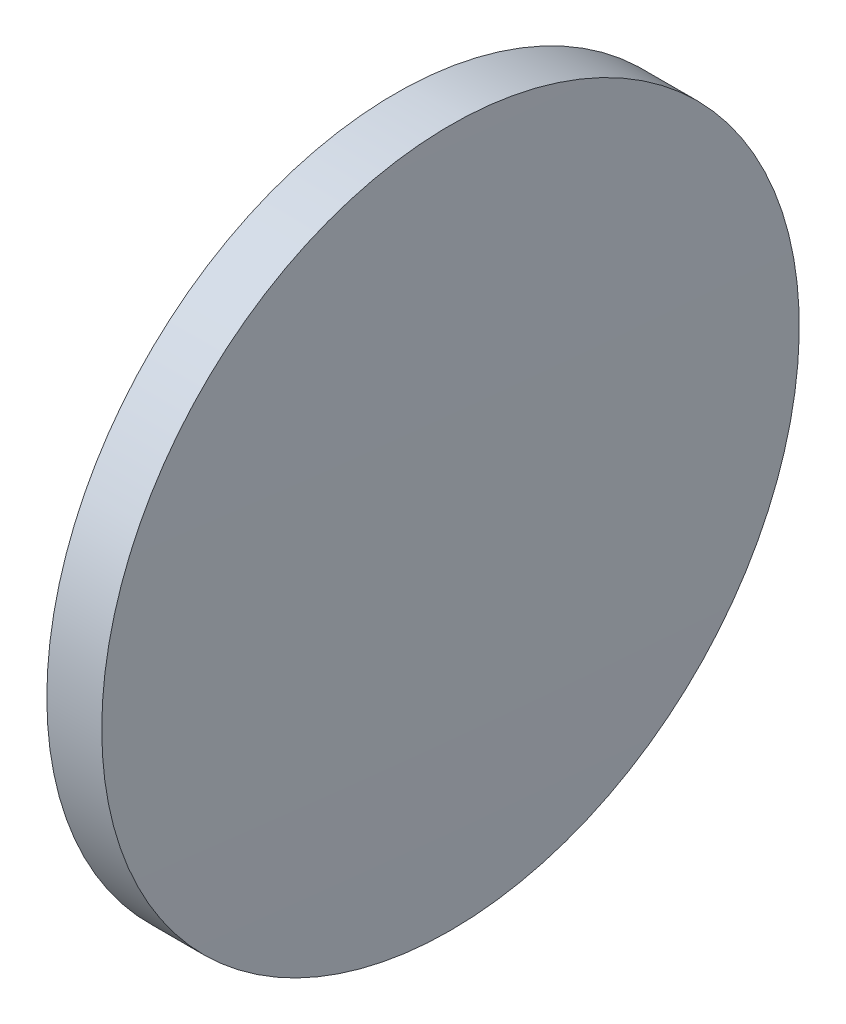
ISO-10303-21;
HEADER;
FILE_DESCRIPTION(('STEP AP214'),'2;1');
FILE_NAME('part.step','',(''),(''),'','','');
FILE_SCHEMA(('AUTOMOTIVE_DESIGN { 1 0 10303 214 1 1 1 1 }'));
ENDSEC;
DATA;
#1=APPLICATION_CONTEXT('core data for automotive mechanical design processes');
#2=APPLICATION_PROTOCOL_DEFINITION('international standard','automotive_design',2000,#1);
#3=PRODUCT_CONTEXT('',#1,'mechanical');
#4=PRODUCT('Part','Part','',(#3));
#5=PRODUCT_RELATED_PRODUCT_CATEGORY('part','',(#4));
#6=PRODUCT_DEFINITION_FORMATION('','',#4);
#7=PRODUCT_DEFINITION_CONTEXT('part definition',#1,'design');
#8=PRODUCT_DEFINITION('design','',#6,#7);
#9=PRODUCT_DEFINITION_SHAPE('','',#8);
#10=(LENGTH_UNIT() NAMED_UNIT(*) SI_UNIT(.MILLI.,.METRE.));
#11=(NAMED_UNIT(*) PLANE_ANGLE_UNIT() SI_UNIT($,.RADIAN.));
#12=(NAMED_UNIT(*) SI_UNIT($,.STERADIAN.) SOLID_ANGLE_UNIT());
#13=UNCERTAINTY_MEASURE_WITH_UNIT(LENGTH_MEASURE(1.E-05),#10,'distance_accuracy_value','');
#14=(GEOMETRIC_REPRESENTATION_CONTEXT(3) GLOBAL_UNCERTAINTY_ASSIGNED_CONTEXT((#13)) GLOBAL_UNIT_ASSIGNED_CONTEXT((#10,
#11,#12)) REPRESENTATION_CONTEXT('',''));
#15=CARTESIAN_POINT('',(0.,0.,0.));
#16=DIRECTION('',(0.,0.,1.));
#17=DIRECTION('',(1.,0.,0.));
#18=AXIS2_PLACEMENT_3D('',#15,#16,#17);
#19=CARTESIAN_POINT('',(-300.851556485468,171.140287979567,0.));
#20=DIRECTION('',(-1.,0.,0.));
#21=DIRECTION('',(0.,-1.,0.));
#22=AXIS2_PLACEMENT_3D('',#19,#20,#21);
#23=SPHERICAL_SURFACE('',#22,806.500000000046);
#24=CARTESIAN_POINT('',(505.548443514578,171.140287979567,0.));
#25=DIRECTION('',(-1.,0.,0.));
#26=DIRECTION('',(0.,0.,1.));
#27=AXIS2_PLACEMENT_3D('',#24,#25,#26);
#28=CIRCLE('',#27,12.7);
#29=CARTESIAN_POINT('',(505.548443514578,171.140287979567,12.7));
#30=VERTEX_POINT('',#29);
#31=EDGE_CURVE('E10',#30,#30,#28,.T.);
#32=ORIENTED_EDGE('',*,*,#31,.F.);
#33=EDGE_LOOP('',(#32));
#34=FACE_BOUND('',#33,.T.);
#35=ADVANCED_FACE('F35',(#34),#23,.T.);
#36=CARTESIAN_POINT('',(497.810225478902,171.140287979567,0.));
#37=DIRECTION('',(-1.,0.,0.));
#38=DIRECTION('',(0.,0.,1.));
#39=AXIS2_PLACEMENT_3D('',#36,#37,#38);
#40=CYLINDRICAL_SURFACE('',#39,12.7);
#41=CARTESIAN_POINT('',(503.548443514578,171.140287979567,0.));
#42=DIRECTION('',(-1.,0.,0.));
#43=DIRECTION('',(0.,0.,1.));
#44=AXIS2_PLACEMENT_3D('',#41,#42,#43);
#45=CIRCLE('',#44,12.7);
#46=CARTESIAN_POINT('',(503.548443514578,171.140287979567,12.7));
#47=VERTEX_POINT('',#46);
#48=EDGE_CURVE('E41',#47,#47,#45,.T.);
#49=ORIENTED_EDGE('',*,*,#48,.F.);
#50=EDGE_LOOP('',(#49));
#51=FACE_BOUND('',#50,.T.);
#52=ORIENTED_EDGE('',*,*,#31,.T.);
#53=EDGE_LOOP('',(#52));
#54=FACE_BOUND('',#53,.T.);
#55=ADVANCED_FACE('F49',(#51,#54),#40,.T.);
#56=CARTESIAN_POINT('',(503.548443514578,171.140287979567,0.));
#57=DIRECTION('',(1.,0.,0.));
#58=DIRECTION('',(0.,0.,-1.));
#59=AXIS2_PLACEMENT_3D('',#56,#57,#58);
#60=PLANE('',#59);
#61=ORIENTED_EDGE('',*,*,#48,.T.);
#62=EDGE_LOOP('',(#61));
#63=FACE_BOUND('',#62,.T.);
#64=ADVANCED_FACE('F47',(#63),#60,.F.);
#65=CLOSED_SHELL('',(#35,#55,#64));
#66=MANIFOLD_SOLID_BREP('B2',#65);
#67=ADVANCED_BREP_SHAPE_REPRESENTATION('',(#18,#66),#14);
#68=SHAPE_DEFINITION_REPRESENTATION(#9,#67);
ENDSEC;
END-ISO-10303-21;
